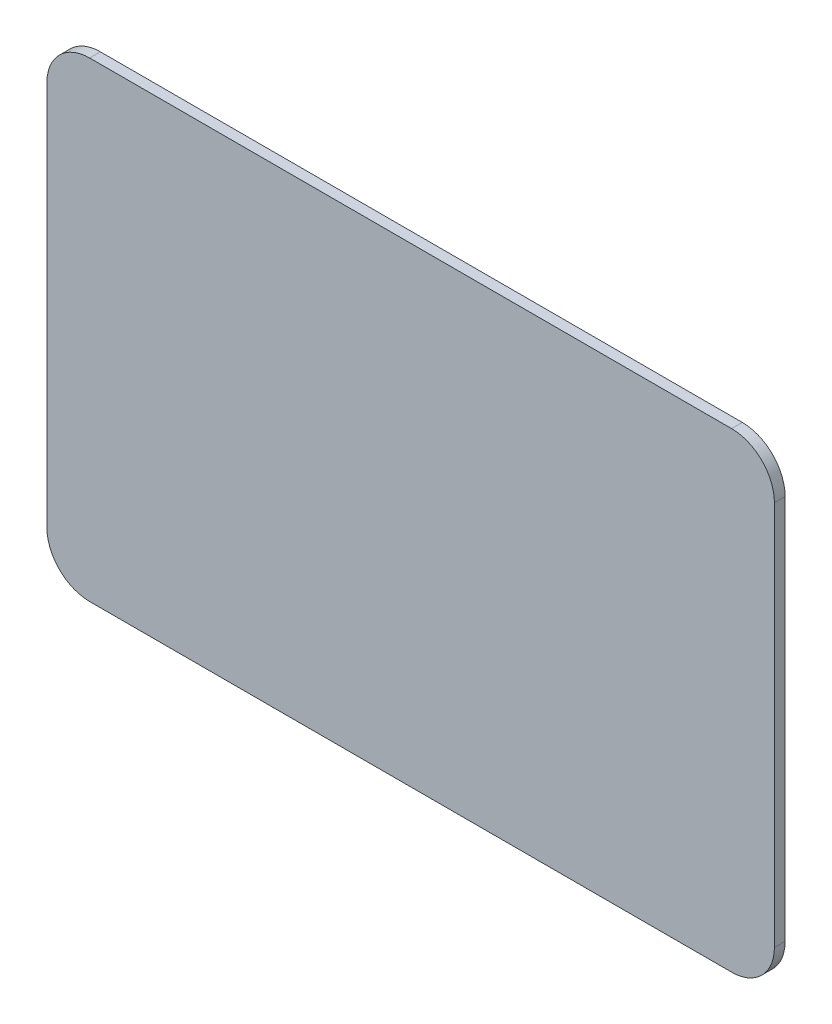
ISO-10303-21;
HEADER;
FILE_DESCRIPTION(('STEP AP214'),'2;1');
FILE_NAME('part.step','',(''),(''),'','','');
FILE_SCHEMA(('AUTOMOTIVE_DESIGN { 1 0 10303 214 1 1 1 1 }'));
ENDSEC;
DATA;
#1=APPLICATION_CONTEXT('core data for automotive mechanical design processes');
#2=APPLICATION_PROTOCOL_DEFINITION('international standard','automotive_design',2000,#1);
#3=PRODUCT_CONTEXT('',#1,'mechanical');
#4=PRODUCT('Part','Part','',(#3));
#5=PRODUCT_RELATED_PRODUCT_CATEGORY('part','',(#4));
#6=PRODUCT_DEFINITION_FORMATION('','',#4);
#7=PRODUCT_DEFINITION_CONTEXT('part definition',#1,'design');
#8=PRODUCT_DEFINITION('design','',#6,#7);
#9=PRODUCT_DEFINITION_SHAPE('','',#8);
#10=(LENGTH_UNIT() NAMED_UNIT(*) SI_UNIT(.MILLI.,.METRE.));
#11=(NAMED_UNIT(*) PLANE_ANGLE_UNIT() SI_UNIT($,.RADIAN.));
#12=(NAMED_UNIT(*) SI_UNIT($,.STERADIAN.) SOLID_ANGLE_UNIT());
#13=UNCERTAINTY_MEASURE_WITH_UNIT(LENGTH_MEASURE(1.E-05),#10,'distance_accuracy_value','');
#14=(GEOMETRIC_REPRESENTATION_CONTEXT(3) GLOBAL_UNCERTAINTY_ASSIGNED_CONTEXT((#13)) GLOBAL_UNIT_ASSIGNED_CONTEXT((#10,
#11,#12)) REPRESENTATION_CONTEXT('',''));
#15=CARTESIAN_POINT('',(0.,0.,0.));
#16=DIRECTION('',(0.,0.,1.));
#17=DIRECTION('',(1.,0.,0.));
#18=AXIS2_PLACEMENT_3D('',#15,#16,#17);
#19=CARTESIAN_POINT('',(53.975,34.925,1.5875));
#20=DIRECTION('',(-1.,0.,0.));
#21=DIRECTION('',(0.,-1.,0.));
#22=AXIS2_PLACEMENT_3D('',#19,#20,#21);
#23=PLANE('',#22);
#24=DIRECTION('',(0.,1.,0.));
#25=VECTOR('',#24,1.);
#26=CARTESIAN_POINT('',(53.975,34.925,1.5875));
#27=LINE('',#26,#25);
#28=CARTESIAN_POINT('',(53.975,-28.575,1.5875));
#29=VERTEX_POINT('',#28);
#30=CARTESIAN_POINT('',(53.975,28.575,1.5875));
#31=VERTEX_POINT('',#30);
#32=EDGE_CURVE('E117',#29,#31,#27,.T.);
#33=ORIENTED_EDGE('',*,*,#32,.F.);
#34=DIRECTION('',(0.,0.,-1.));
#35=VECTOR('',#34,1.);
#36=CARTESIAN_POINT('',(53.975,-28.575,1.5875));
#37=LINE('',#36,#35);
#38=CARTESIAN_POINT('',(53.975,-28.575,0.));
#39=VERTEX_POINT('',#38);
#40=EDGE_CURVE('E102',#29,#39,#37,.T.);
#41=ORIENTED_EDGE('',*,*,#40,.T.);
#42=DIRECTION('',(0.,1.,0.));
#43=VECTOR('',#42,1.);
#44=CARTESIAN_POINT('',(53.975,34.925,0.));
#45=LINE('',#44,#43);
#46=CARTESIAN_POINT('',(53.975,28.575,0.));
#47=VERTEX_POINT('',#46);
#48=EDGE_CURVE('E114',#39,#47,#45,.T.);
#49=ORIENTED_EDGE('',*,*,#48,.T.);
#50=DIRECTION('',(0.,0.,-1.));
#51=VECTOR('',#50,1.);
#52=CARTESIAN_POINT('',(53.975,28.575,1.5875));
#53=LINE('',#52,#51);
#54=EDGE_CURVE('E119',#47,#31,#53,.F.);
#55=ORIENTED_EDGE('',*,*,#54,.T.);
#56=EDGE_LOOP('',(#33,#41,#49,#55));
#57=FACE_BOUND('',#56,.T.);
#58=ADVANCED_FACE('F32',(#57),#23,.F.);
#59=CARTESIAN_POINT('',(-53.975,34.925,1.5875));
#60=DIRECTION('',(0.,-1.,0.));
#61=DIRECTION('',(0.,0.,-1.));
#62=AXIS2_PLACEMENT_3D('',#59,#60,#61);
#63=PLANE('',#62);
#64=DIRECTION('',(-1.,0.,0.));
#65=VECTOR('',#64,1.);
#66=CARTESIAN_POINT('',(-53.975,34.925,1.5875));
#67=LINE('',#66,#65);
#68=CARTESIAN_POINT('',(47.625,34.925,1.5875));
#69=VERTEX_POINT('',#68);
#70=CARTESIAN_POINT('',(-47.625,34.925,1.5875));
#71=VERTEX_POINT('',#70);
#72=EDGE_CURVE('E159',#69,#71,#67,.T.);
#73=ORIENTED_EDGE('',*,*,#72,.F.);
#74=DIRECTION('',(0.,0.,-1.));
#75=VECTOR('',#74,1.);
#76=CARTESIAN_POINT('',(47.625,34.925,1.5875));
#77=LINE('',#76,#75);
#78=CARTESIAN_POINT('',(47.625,34.925,0.));
#79=VERTEX_POINT('',#78);
#80=EDGE_CURVE('E152',#69,#79,#77,.T.);
#81=ORIENTED_EDGE('',*,*,#80,.T.);
#82=DIRECTION('',(-1.,0.,0.));
#83=VECTOR('',#82,1.);
#84=CARTESIAN_POINT('',(-53.975,34.925,0.));
#85=LINE('',#84,#83);
#86=CARTESIAN_POINT('',(-47.625,34.925,0.));
#87=VERTEX_POINT('',#86);
#88=EDGE_CURVE('E123',#79,#87,#85,.T.);
#89=ORIENTED_EDGE('',*,*,#88,.T.);
#90=DIRECTION('',(0.,0.,-1.));
#91=VECTOR('',#90,1.);
#92=CARTESIAN_POINT('',(-47.625,34.925,1.5875));
#93=LINE('',#92,#91);
#94=EDGE_CURVE('E150',#87,#71,#93,.F.);
#95=ORIENTED_EDGE('',*,*,#94,.T.);
#96=EDGE_LOOP('',(#73,#81,#89,#95));
#97=FACE_BOUND('',#96,.T.);
#98=ADVANCED_FACE('F157',(#97),#63,.F.);
#99=CARTESIAN_POINT('',(-53.975,34.925,1.5875));
#100=DIRECTION('',(1.,0.,0.));
#101=DIRECTION('',(0.,1.,0.));
#102=AXIS2_PLACEMENT_3D('',#99,#100,#101);
#103=PLANE('',#102);
#104=DIRECTION('',(0.,-1.,0.));
#105=VECTOR('',#104,1.);
#106=CARTESIAN_POINT('',(-53.975,34.925,1.5875));
#107=LINE('',#106,#105);
#108=CARTESIAN_POINT('',(-53.975,28.575,1.5875));
#109=VERTEX_POINT('',#108);
#110=CARTESIAN_POINT('',(-53.975,-28.575,1.5875));
#111=VERTEX_POINT('',#110);
#112=EDGE_CURVE('E167',#109,#111,#107,.T.);
#113=ORIENTED_EDGE('',*,*,#112,.F.);
#114=DIRECTION('',(0.,0.,-1.));
#115=VECTOR('',#114,1.);
#116=CARTESIAN_POINT('',(-53.975,28.575,1.5875));
#117=LINE('',#116,#115);
#118=CARTESIAN_POINT('',(-53.975,28.575,0.));
#119=VERTEX_POINT('',#118);
#120=EDGE_CURVE('E11',#109,#119,#117,.T.);
#121=ORIENTED_EDGE('',*,*,#120,.T.);
#122=DIRECTION('',(0.,-1.,0.));
#123=VECTOR('',#122,1.);
#124=CARTESIAN_POINT('',(-53.975,34.925,0.));
#125=LINE('',#124,#123);
#126=CARTESIAN_POINT('',(-53.975,-28.575,0.));
#127=VERTEX_POINT('',#126);
#128=EDGE_CURVE('E126',#119,#127,#125,.T.);
#129=ORIENTED_EDGE('',*,*,#128,.T.);
#130=DIRECTION('',(0.,0.,-1.));
#131=VECTOR('',#130,1.);
#132=CARTESIAN_POINT('',(-53.975,-28.575,1.5875));
#133=LINE('',#132,#131);
#134=EDGE_CURVE('E40',#127,#111,#133,.F.);
#135=ORIENTED_EDGE('',*,*,#134,.T.);
#136=EDGE_LOOP('',(#113,#121,#129,#135));
#137=FACE_BOUND('',#136,.T.);
#138=ADVANCED_FACE('F166',(#137),#103,.F.);
#139=CARTESIAN_POINT('',(-53.975,-34.925,1.5875));
#140=DIRECTION('',(0.,1.,0.));
#141=DIRECTION('',(0.,0.,1.));
#142=AXIS2_PLACEMENT_3D('',#139,#140,#141);
#143=PLANE('',#142);
#144=DIRECTION('',(1.,0.,0.));
#145=VECTOR('',#144,1.);
#146=CARTESIAN_POINT('',(-53.975,-34.925,0.));
#147=LINE('',#146,#145);
#148=CARTESIAN_POINT('',(-47.625,-34.925,0.));
#149=VERTEX_POINT('',#148);
#150=CARTESIAN_POINT('',(47.625,-34.925,0.));
#151=VERTEX_POINT('',#150);
#152=EDGE_CURVE('E133',#149,#151,#147,.T.);
#153=ORIENTED_EDGE('',*,*,#152,.T.);
#154=DIRECTION('',(0.,0.,-1.));
#155=VECTOR('',#154,1.);
#156=CARTESIAN_POINT('',(47.625,-34.925,1.5875));
#157=LINE('',#156,#155);
#158=CARTESIAN_POINT('',(47.625,-34.925,1.5875));
#159=VERTEX_POINT('',#158);
#160=EDGE_CURVE('E103',#151,#159,#157,.F.);
#161=ORIENTED_EDGE('',*,*,#160,.T.);
#162=DIRECTION('',(1.,0.,0.));
#163=VECTOR('',#162,1.);
#164=CARTESIAN_POINT('',(-53.975,-34.925,1.5875));
#165=LINE('',#164,#163);
#166=CARTESIAN_POINT('',(-47.625,-34.925,1.5875));
#167=VERTEX_POINT('',#166);
#168=EDGE_CURVE('E129',#167,#159,#165,.T.);
#169=ORIENTED_EDGE('',*,*,#168,.F.);
#170=DIRECTION('',(0.,0.,-1.));
#171=VECTOR('',#170,1.);
#172=CARTESIAN_POINT('',(-47.625,-34.925,1.5875));
#173=LINE('',#172,#171);
#174=EDGE_CURVE('E108',#167,#149,#173,.T.);
#175=ORIENTED_EDGE('',*,*,#174,.T.);
#176=EDGE_LOOP('',(#153,#161,#169,#175));
#177=FACE_BOUND('',#176,.T.);
#178=ADVANCED_FACE('F190',(#177),#143,.F.);
#179=CARTESIAN_POINT('',(0.,0.,1.5875));
#180=DIRECTION('',(0.,0.,1.));
#181=DIRECTION('',(1.,0.,0.));
#182=AXIS2_PLACEMENT_3D('',#179,#180,#181);
#183=PLANE('',#182);
#184=ORIENTED_EDGE('',*,*,#168,.T.);
#185=CARTESIAN_POINT('',(47.625,-28.575,1.5875));
#186=DIRECTION('',(0.,0.,1.));
#187=DIRECTION('',(1.,0.,0.));
#188=AXIS2_PLACEMENT_3D('',#185,#186,#187);
#189=CIRCLE('',#188,6.35);
#190=EDGE_CURVE('E148',#159,#29,#189,.T.);
#191=ORIENTED_EDGE('',*,*,#190,.T.);
#192=ORIENTED_EDGE('',*,*,#32,.T.);
#193=CARTESIAN_POINT('',(47.625,28.575,1.5875));
#194=DIRECTION('',(0.,0.,1.));
#195=DIRECTION('',(1.,0.,0.));
#196=AXIS2_PLACEMENT_3D('',#193,#194,#195);
#197=CIRCLE('',#196,6.35);
#198=EDGE_CURVE('E146',#31,#69,#197,.T.);
#199=ORIENTED_EDGE('',*,*,#198,.T.);
#200=ORIENTED_EDGE('',*,*,#72,.T.);
#201=CARTESIAN_POINT('',(-47.625,28.575,1.5875));
#202=DIRECTION('',(0.,0.,1.));
#203=DIRECTION('',(1.,0.,0.));
#204=AXIS2_PLACEMENT_3D('',#201,#202,#203);
#205=CIRCLE('',#204,6.35);
#206=EDGE_CURVE('E53',#71,#109,#205,.T.);
#207=ORIENTED_EDGE('',*,*,#206,.T.);
#208=ORIENTED_EDGE('',*,*,#112,.T.);
#209=CARTESIAN_POINT('',(-47.625,-28.575,1.5875));
#210=DIRECTION('',(0.,0.,1.));
#211=DIRECTION('',(1.,0.,0.));
#212=AXIS2_PLACEMENT_3D('',#209,#210,#211);
#213=CIRCLE('',#212,6.35);
#214=EDGE_CURVE('E143',#111,#167,#213,.T.);
#215=ORIENTED_EDGE('',*,*,#214,.T.);
#216=EDGE_LOOP('',(#184,#191,#192,#199,#200,#207,#208,#215));
#217=FACE_BOUND('',#216,.T.);
#218=ADVANCED_FACE('F172',(#217),#183,.T.);
#219=CARTESIAN_POINT('',(0.,0.,0.));
#220=DIRECTION('',(0.,0.,1.));
#221=DIRECTION('',(1.,0.,0.));
#222=AXIS2_PLACEMENT_3D('',#219,#220,#221);
#223=PLANE('',#222);
#224=ORIENTED_EDGE('',*,*,#48,.F.);
#225=CARTESIAN_POINT('',(47.625,-28.575,0.));
#226=DIRECTION('',(0.,0.,1.));
#227=DIRECTION('',(1.,0.,0.));
#228=AXIS2_PLACEMENT_3D('',#225,#226,#227);
#229=CIRCLE('',#228,6.35);
#230=EDGE_CURVE('E98',#39,#151,#229,.F.);
#231=ORIENTED_EDGE('',*,*,#230,.T.);
#232=ORIENTED_EDGE('',*,*,#152,.F.);
#233=CARTESIAN_POINT('',(-47.625,-28.575,0.));
#234=DIRECTION('',(0.,0.,1.));
#235=DIRECTION('',(1.,0.,0.));
#236=AXIS2_PLACEMENT_3D('',#233,#234,#235);
#237=CIRCLE('',#236,6.35);
#238=EDGE_CURVE('E118',#149,#127,#237,.F.);
#239=ORIENTED_EDGE('',*,*,#238,.T.);
#240=ORIENTED_EDGE('',*,*,#128,.F.);
#241=CARTESIAN_POINT('',(-47.625,28.575,0.));
#242=DIRECTION('',(0.,0.,1.));
#243=DIRECTION('',(1.,0.,0.));
#244=AXIS2_PLACEMENT_3D('',#241,#242,#243);
#245=CIRCLE('',#244,6.35);
#246=EDGE_CURVE('E137',#119,#87,#245,.F.);
#247=ORIENTED_EDGE('',*,*,#246,.T.);
#248=ORIENTED_EDGE('',*,*,#88,.F.);
#249=CARTESIAN_POINT('',(47.625,28.575,0.));
#250=DIRECTION('',(0.,0.,1.));
#251=DIRECTION('',(1.,0.,0.));
#252=AXIS2_PLACEMENT_3D('',#249,#250,#251);
#253=CIRCLE('',#252,6.35);
#254=EDGE_CURVE('E109',#79,#47,#253,.F.);
#255=ORIENTED_EDGE('',*,*,#254,.T.);
#256=EDGE_LOOP('',(#224,#231,#232,#239,#240,#247,#248,#255));
#257=FACE_BOUND('',#256,.T.);
#258=ADVANCED_FACE('F121',(#257),#223,.F.);
#259=CARTESIAN_POINT('',(47.625,-28.575,1.5875));
#260=DIRECTION('',(0.,0.,-1.));
#261=DIRECTION('',(-1.,0.,0.));
#262=AXIS2_PLACEMENT_3D('',#259,#260,#261);
#263=CYLINDRICAL_SURFACE('',#262,6.35);
#264=ORIENTED_EDGE('',*,*,#190,.F.);
#265=ORIENTED_EDGE('',*,*,#160,.F.);
#266=ORIENTED_EDGE('',*,*,#230,.F.);
#267=ORIENTED_EDGE('',*,*,#40,.F.);
#268=EDGE_LOOP('',(#264,#265,#266,#267));
#269=FACE_BOUND('',#268,.T.);
#270=ADVANCED_FACE('F101',(#269),#263,.T.);
#271=CARTESIAN_POINT('',(47.625,28.575,1.5875));
#272=DIRECTION('',(0.,0.,-1.));
#273=DIRECTION('',(-1.,0.,0.));
#274=AXIS2_PLACEMENT_3D('',#271,#272,#273);
#275=CYLINDRICAL_SURFACE('',#274,6.35);
#276=ORIENTED_EDGE('',*,*,#198,.F.);
#277=ORIENTED_EDGE('',*,*,#54,.F.);
#278=ORIENTED_EDGE('',*,*,#254,.F.);
#279=ORIENTED_EDGE('',*,*,#80,.F.);
#280=EDGE_LOOP('',(#276,#277,#278,#279));
#281=FACE_BOUND('',#280,.T.);
#282=ADVANCED_FACE('F173',(#281),#275,.T.);
#283=CARTESIAN_POINT('',(-47.625,28.575,1.5875));
#284=DIRECTION('',(0.,0.,-1.));
#285=DIRECTION('',(-1.,0.,0.));
#286=AXIS2_PLACEMENT_3D('',#283,#284,#285);
#287=CYLINDRICAL_SURFACE('',#286,6.35);
#288=ORIENTED_EDGE('',*,*,#206,.F.);
#289=ORIENTED_EDGE('',*,*,#94,.F.);
#290=ORIENTED_EDGE('',*,*,#246,.F.);
#291=ORIENTED_EDGE('',*,*,#120,.F.);
#292=EDGE_LOOP('',(#288,#289,#290,#291));
#293=FACE_BOUND('',#292,.T.);
#294=ADVANCED_FACE('F165',(#293),#287,.T.);
#295=CARTESIAN_POINT('',(-47.625,-28.575,1.5875));
#296=DIRECTION('',(0.,0.,-1.));
#297=DIRECTION('',(-1.,0.,0.));
#298=AXIS2_PLACEMENT_3D('',#295,#296,#297);
#299=CYLINDRICAL_SURFACE('',#298,6.35);
#300=ORIENTED_EDGE('',*,*,#214,.F.);
#301=ORIENTED_EDGE('',*,*,#134,.F.);
#302=ORIENTED_EDGE('',*,*,#238,.F.);
#303=ORIENTED_EDGE('',*,*,#174,.F.);
#304=EDGE_LOOP('',(#300,#301,#302,#303));
#305=FACE_BOUND('',#304,.T.);
#306=ADVANCED_FACE('F34',(#305),#299,.T.);
#307=CLOSED_SHELL('',(#58,#98,#138,#178,#218,#258,#270,#282,#294,#306));
#308=MANIFOLD_SOLID_BREP('B2',#307);
#309=ADVANCED_BREP_SHAPE_REPRESENTATION('',(#18,#308),#14);
#310=SHAPE_DEFINITION_REPRESENTATION(#9,#309);
ENDSEC;
END-ISO-10303-21;
